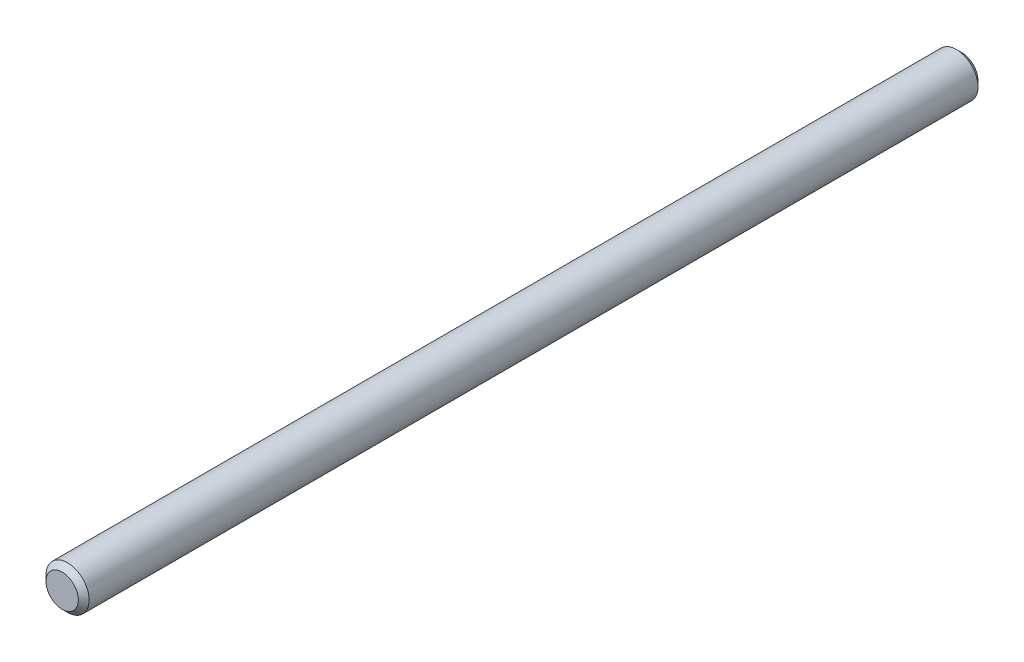
ISO-10303-21;
HEADER;
FILE_DESCRIPTION(('STEP AP214'),'2;1');
FILE_NAME('part.step','',(''),(''),'','','');
FILE_SCHEMA(('AUTOMOTIVE_DESIGN { 1 0 10303 214 1 1 1 1 }'));
ENDSEC;
DATA;
#1=APPLICATION_CONTEXT('core data for automotive mechanical design processes');
#2=APPLICATION_PROTOCOL_DEFINITION('international standard','automotive_design',2000,#1);
#3=PRODUCT_CONTEXT('',#1,'mechanical');
#4=PRODUCT('Part','Part','',(#3));
#5=PRODUCT_RELATED_PRODUCT_CATEGORY('part','',(#4));
#6=PRODUCT_DEFINITION_FORMATION('','',#4);
#7=PRODUCT_DEFINITION_CONTEXT('part definition',#1,'design');
#8=PRODUCT_DEFINITION('design','',#6,#7);
#9=PRODUCT_DEFINITION_SHAPE('','',#8);
#10=(LENGTH_UNIT() NAMED_UNIT(*) SI_UNIT(.MILLI.,.METRE.));
#11=(NAMED_UNIT(*) PLANE_ANGLE_UNIT() SI_UNIT($,.RADIAN.));
#12=(NAMED_UNIT(*) SI_UNIT($,.STERADIAN.) SOLID_ANGLE_UNIT());
#13=UNCERTAINTY_MEASURE_WITH_UNIT(LENGTH_MEASURE(1.E-05),#10,'distance_accuracy_value','');
#14=(GEOMETRIC_REPRESENTATION_CONTEXT(3) GLOBAL_UNCERTAINTY_ASSIGNED_CONTEXT((#13)) GLOBAL_UNIT_ASSIGNED_CONTEXT((#10,
#11,#12)) REPRESENTATION_CONTEXT('',''));
#15=CARTESIAN_POINT('',(0.,0.,0.));
#16=DIRECTION('',(0.,0.,1.));
#17=DIRECTION('',(1.,0.,0.));
#18=AXIS2_PLACEMENT_3D('',#15,#16,#17);
#19=CARTESIAN_POINT('',(0.,0.,277.313708498984));
#20=DIRECTION('',(0.,0.,-1.));
#21=DIRECTION('',(-1.,0.,0.));
#22=AXIS2_PLACEMENT_3D('',#19,#20,#21);
#23=CYLINDRICAL_SURFACE('',#22,4.);
#24=CARTESIAN_POINT('',(0.,0.,265.));
#25=DIRECTION('',(0.,0.,1.));
#26=DIRECTION('',(1.,0.,0.));
#27=AXIS2_PLACEMENT_3D('',#24,#25,#26);
#28=CIRCLE('',#27,4.);
#29=CARTESIAN_POINT('',(4.,0.,265.));
#30=VERTEX_POINT('',#29);
#31=EDGE_CURVE('E37',#30,#30,#28,.F.);
#32=ORIENTED_EDGE('',*,*,#31,.T.);
#33=EDGE_LOOP('',(#32));
#34=FACE_BOUND('',#33,.T.);
#35=CARTESIAN_POINT('',(0.,0.,99.9999999999996));
#36=DIRECTION('',(0.,0.,1.));
#37=DIRECTION('',(1.,0.,0.));
#38=AXIS2_PLACEMENT_3D('',#35,#36,#37);
#39=CIRCLE('',#38,4.);
#40=CARTESIAN_POINT('',(4.,0.,99.9999999999996));
#41=VERTEX_POINT('',#40);
#42=EDGE_CURVE('E41',#41,#41,#39,.T.);
#43=ORIENTED_EDGE('',*,*,#42,.T.);
#44=EDGE_LOOP('',(#43));
#45=FACE_BOUND('',#44,.T.);
#46=ADVANCED_FACE('F30',(#34,#45),#23,.T.);
#47=CARTESIAN_POINT('',(0.,0.,98.9999999999996));
#48=DIRECTION('',(0.,0.,1.));
#49=DIRECTION('',(1.,0.,0.));
#50=AXIS2_PLACEMENT_3D('',#47,#48,#49);
#51=PLANE('',#50);
#52=CARTESIAN_POINT('',(0.,0.,98.9999999999996));
#53=DIRECTION('',(0.,0.,1.));
#54=DIRECTION('',(1.,0.,0.));
#55=AXIS2_PLACEMENT_3D('',#52,#53,#54);
#56=CIRCLE('',#55,3.00000000000003);
#57=CARTESIAN_POINT('',(3.00000000000003,0.,98.9999999999996));
#58=VERTEX_POINT('',#57);
#59=EDGE_CURVE('E10',#58,#58,#56,.F.);
#60=ORIENTED_EDGE('',*,*,#59,.T.);
#61=EDGE_LOOP('',(#60));
#62=FACE_BOUND('',#61,.T.);
#63=ADVANCED_FACE('F61',(#62),#51,.F.);
#64=CARTESIAN_POINT('',(-9.94821324890703,15.3200883296794,266.));
#65=DIRECTION('',(0.,0.,1.));
#66=DIRECTION('',(-0.791135779801378,-0.611640562682092,0.));
#67=AXIS2_PLACEMENT_3D('',#64,#65,#66);
#68=PLANE('',#67);
#69=CARTESIAN_POINT('',(0.,0.,266.));
#70=DIRECTION('',(0.,0.,1.));
#71=DIRECTION('',(1.,0.,0.));
#72=AXIS2_PLACEMENT_3D('',#69,#70,#71);
#73=CIRCLE('',#72,3.00000000000002);
#74=CARTESIAN_POINT('',(3.00000000000002,0.,266.));
#75=VERTEX_POINT('',#74);
#76=EDGE_CURVE('E45',#75,#75,#73,.T.);
#77=ORIENTED_EDGE('',*,*,#76,.T.);
#78=EDGE_LOOP('',(#77));
#79=FACE_BOUND('',#78,.T.);
#80=ADVANCED_FACE('F51',(#79),#68,.T.);
#81=CARTESIAN_POINT('',(0.,0.,266.));
#82=DIRECTION('',(0.,0.,-1.));
#83=DIRECTION('',(-1.,0.,0.));
#84=AXIS2_PLACEMENT_3D('',#81,#82,#83);
#85=CONICAL_SURFACE('',#84,3.00000000000002,0.785398163397438);
#86=ORIENTED_EDGE('',*,*,#31,.F.);
#87=EDGE_LOOP('',(#86));
#88=FACE_BOUND('',#87,.T.);
#89=ORIENTED_EDGE('',*,*,#76,.F.);
#90=EDGE_LOOP('',(#89));
#91=FACE_BOUND('',#90,.T.);
#92=ADVANCED_FACE('F53',(#88,#91),#85,.T.);
#93=CARTESIAN_POINT('',(0.,0.,99.9999999999996));
#94=DIRECTION('',(0.,0.,1.));
#95=DIRECTION('',(1.,0.,0.));
#96=AXIS2_PLACEMENT_3D('',#93,#94,#95);
#97=CONICAL_SURFACE('',#96,4.,0.785398163397453);
#98=ORIENTED_EDGE('',*,*,#59,.F.);
#99=EDGE_LOOP('',(#98));
#100=FACE_BOUND('',#99,.T.);
#101=ORIENTED_EDGE('',*,*,#42,.F.);
#102=EDGE_LOOP('',(#101));
#103=FACE_BOUND('',#102,.T.);
#104=ADVANCED_FACE('F32',(#100,#103),#97,.T.);
#105=CLOSED_SHELL('',(#46,#63,#80,#92,#104));
#106=MANIFOLD_SOLID_BREP('B2',#105);
#107=ADVANCED_BREP_SHAPE_REPRESENTATION('',(#18,#106),#14);
#108=SHAPE_DEFINITION_REPRESENTATION(#9,#107);
ENDSEC;
END-ISO-10303-21;
